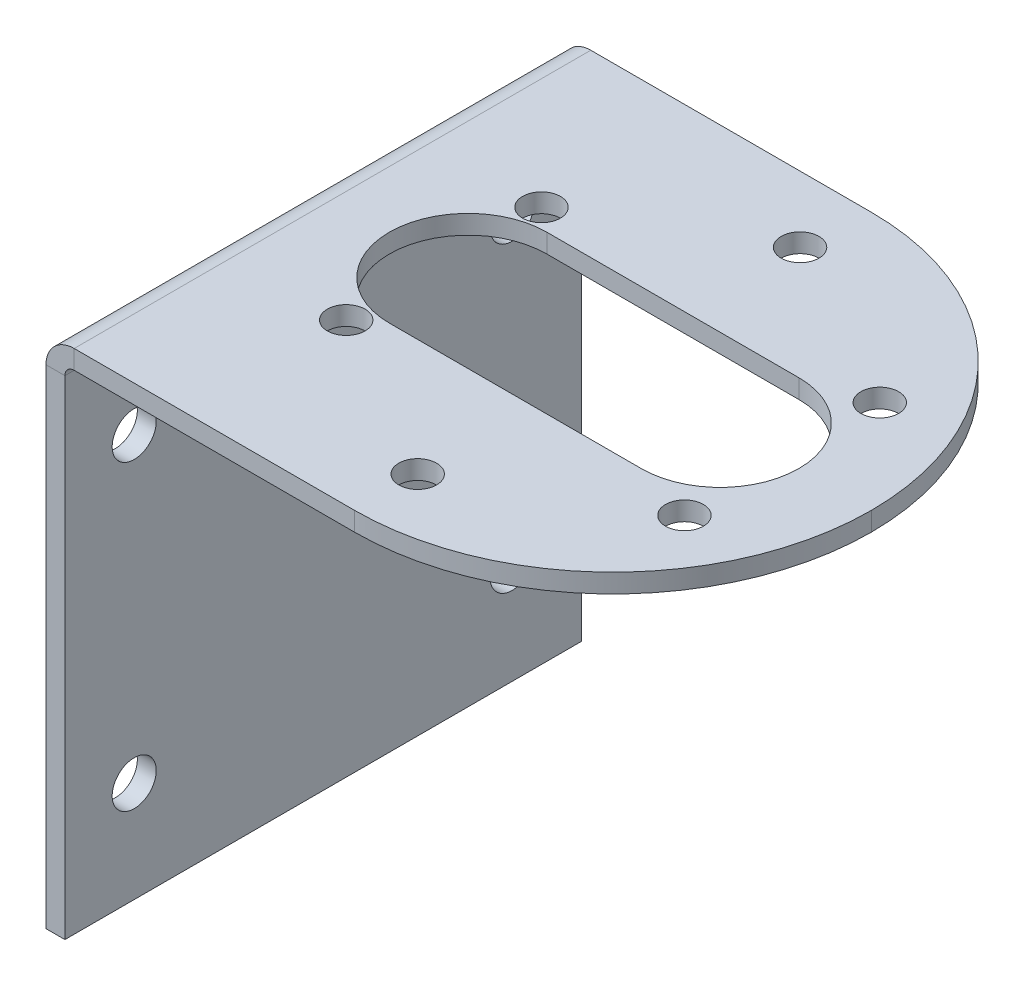
ISO-10303-21;
HEADER;
FILE_DESCRIPTION(('STEP AP214'),'2;1');
FILE_NAME('part.step','',(''),(''),'','','');
FILE_SCHEMA(('AUTOMOTIVE_DESIGN { 1 0 10303 214 1 1 1 1 }'));
ENDSEC;
DATA;
#1=APPLICATION_CONTEXT('core data for automotive mechanical design processes');
#2=APPLICATION_PROTOCOL_DEFINITION('international standard','automotive_design',2000,#1);
#3=PRODUCT_CONTEXT('',#1,'mechanical');
#4=PRODUCT('Part','Part','',(#3));
#5=PRODUCT_RELATED_PRODUCT_CATEGORY('part','',(#4));
#6=PRODUCT_DEFINITION_FORMATION('','',#4);
#7=PRODUCT_DEFINITION_CONTEXT('part definition',#1,'design');
#8=PRODUCT_DEFINITION('design','',#6,#7);
#9=PRODUCT_DEFINITION_SHAPE('','',#8);
#10=(LENGTH_UNIT() NAMED_UNIT(*) SI_UNIT(.MILLI.,.METRE.));
#11=(NAMED_UNIT(*) PLANE_ANGLE_UNIT() SI_UNIT($,.RADIAN.));
#12=(NAMED_UNIT(*) SI_UNIT($,.STERADIAN.) SOLID_ANGLE_UNIT());
#13=UNCERTAINTY_MEASURE_WITH_UNIT(LENGTH_MEASURE(1.E-05),#10,'distance_accuracy_value','');
#14=(GEOMETRIC_REPRESENTATION_CONTEXT(3) GLOBAL_UNCERTAINTY_ASSIGNED_CONTEXT((#13)) GLOBAL_UNIT_ASSIGNED_CONTEXT((#10,
#11,#12)) REPRESENTATION_CONTEXT('',''));
#15=CARTESIAN_POINT('',(0.,0.,0.));
#16=DIRECTION('',(0.,0.,1.));
#17=DIRECTION('',(1.,0.,0.));
#18=AXIS2_PLACEMENT_3D('',#15,#16,#17);
#19=CARTESIAN_POINT('',(2.2366,41.,20.5));
#20=DIRECTION('',(0.,0.,1.));
#21=DIRECTION('',(1.,0.,0.));
#22=AXIS2_PLACEMENT_3D('',#19,#20,#21);
#23=PLANE('',#22);
#24=DIRECTION('',(0.,-1.,0.));
#25=VECTOR('',#24,1.);
#26=CARTESIAN_POINT('',(2.2366,41.,20.5));
#27=LINE('',#26,#25);
#28=CARTESIAN_POINT('',(2.2366,41.,20.5));
#29=VERTEX_POINT('',#28);
#30=CARTESIAN_POINT('',(2.2366,39.5,20.5));
#31=VERTEX_POINT('',#30);
#32=EDGE_CURVE('E274',#29,#31,#27,.T.);
#33=ORIENTED_EDGE('',*,*,#32,.F.);
#34=CARTESIAN_POINT('',(2.2366,38.7634,20.5));
#35=DIRECTION('',(0.,0.,1.));
#36=DIRECTION('',(1.,0.,0.));
#37=AXIS2_PLACEMENT_3D('',#34,#35,#36);
#38=CIRCLE('',#37,2.2366);
#39=CARTESIAN_POINT('',(0.,38.7634,20.5));
#40=VERTEX_POINT('',#39);
#41=EDGE_CURVE('E217',#40,#29,#38,.F.);
#42=ORIENTED_EDGE('',*,*,#41,.F.);
#43=DIRECTION('',(-1.,0.,0.));
#44=VECTOR('',#43,1.);
#45=CARTESIAN_POINT('',(1.5,38.7634,20.5));
#46=LINE('',#45,#44);
#47=CARTESIAN_POINT('',(1.5,38.7634,20.5));
#48=VERTEX_POINT('',#47);
#49=EDGE_CURVE('E272',#48,#40,#46,.T.);
#50=ORIENTED_EDGE('',*,*,#49,.F.);
#51=CARTESIAN_POINT('',(2.2366,38.7634,20.5));
#52=DIRECTION('',(0.,0.,1.));
#53=DIRECTION('',(1.,0.,0.));
#54=AXIS2_PLACEMENT_3D('',#51,#52,#53);
#55=CIRCLE('',#54,0.7366);
#56=EDGE_CURVE('E229',#48,#31,#55,.F.);
#57=ORIENTED_EDGE('',*,*,#56,.T.);
#58=EDGE_LOOP('',(#33,#42,#50,#57));
#59=FACE_BOUND('',#58,.T.);
#60=ADVANCED_FACE('F37',(#59),#23,.T.);
#61=CARTESIAN_POINT('',(1.5,38.7634,20.5));
#62=DIRECTION('',(0.,0.,1.));
#63=DIRECTION('',(1.,0.,0.));
#64=AXIS2_PLACEMENT_3D('',#61,#62,#63);
#65=PLANE('',#64);
#66=DIRECTION('',(1.,0.,0.));
#67=VECTOR('',#66,1.);
#68=CARTESIAN_POINT('',(0.,39.5,20.5));
#69=LINE('',#68,#67);
#70=CARTESIAN_POINT('',(24.5,39.5,20.5));
#71=VERTEX_POINT('',#70);
#72=EDGE_CURVE('E210',#31,#71,#69,.T.);
#73=ORIENTED_EDGE('',*,*,#72,.T.);
#74=DIRECTION('',(0.,-1.,0.));
#75=VECTOR('',#74,1.);
#76=CARTESIAN_POINT('',(24.5,38.7634,20.5));
#77=LINE('',#76,#75);
#78=CARTESIAN_POINT('',(24.5,41.,20.5));
#79=VERTEX_POINT('',#78);
#80=EDGE_CURVE('E287',#71,#79,#77,.F.);
#81=ORIENTED_EDGE('',*,*,#80,.T.);
#82=DIRECTION('',(1.,0.,0.));
#83=VECTOR('',#82,1.);
#84=CARTESIAN_POINT('',(0.,41.,20.5));
#85=LINE('',#84,#83);
#86=EDGE_CURVE('E213',#29,#79,#85,.T.);
#87=ORIENTED_EDGE('',*,*,#86,.F.);
#88=ORIENTED_EDGE('',*,*,#32,.T.);
#89=EDGE_LOOP('',(#73,#81,#87,#88));
#90=FACE_BOUND('',#89,.T.);
#91=ADVANCED_FACE('F326',(#90),#65,.T.);
#92=CARTESIAN_POINT('',(0.,38.7634,-20.5));
#93=DIRECTION('',(0.,0.,-1.));
#94=DIRECTION('',(-1.,0.,0.));
#95=AXIS2_PLACEMENT_3D('',#92,#93,#94);
#96=PLANE('',#95);
#97=DIRECTION('',(1.,0.,0.));
#98=VECTOR('',#97,1.);
#99=CARTESIAN_POINT('',(0.,38.7634,-20.5));
#100=LINE('',#99,#98);
#101=CARTESIAN_POINT('',(0.,38.7634,-20.5));
#102=VERTEX_POINT('',#101);
#103=CARTESIAN_POINT('',(1.5,38.7634,-20.5));
#104=VERTEX_POINT('',#103);
#105=EDGE_CURVE('E270',#102,#104,#100,.T.);
#106=ORIENTED_EDGE('',*,*,#105,.F.);
#107=CARTESIAN_POINT('',(2.2366,38.7634,-20.5));
#108=DIRECTION('',(0.,0.,1.));
#109=DIRECTION('',(1.,0.,0.));
#110=AXIS2_PLACEMENT_3D('',#107,#108,#109);
#111=CIRCLE('',#110,2.2366);
#112=CARTESIAN_POINT('',(2.2366,41.,-20.5));
#113=VERTEX_POINT('',#112);
#114=EDGE_CURVE('E239',#102,#113,#111,.F.);
#115=ORIENTED_EDGE('',*,*,#114,.T.);
#116=DIRECTION('',(0.,1.,0.));
#117=VECTOR('',#116,1.);
#118=CARTESIAN_POINT('',(2.2366,39.5,-20.5));
#119=LINE('',#118,#117);
#120=CARTESIAN_POINT('',(2.2366,39.5,-20.5));
#121=VERTEX_POINT('',#120);
#122=EDGE_CURVE('E268',#121,#113,#119,.T.);
#123=ORIENTED_EDGE('',*,*,#122,.F.);
#124=CARTESIAN_POINT('',(2.2366,38.7634,-20.5));
#125=DIRECTION('',(0.,0.,1.));
#126=DIRECTION('',(1.,0.,0.));
#127=AXIS2_PLACEMENT_3D('',#124,#125,#126);
#128=CIRCLE('',#127,0.7366);
#129=EDGE_CURVE('E214',#104,#121,#128,.F.);
#130=ORIENTED_EDGE('',*,*,#129,.F.);
#131=EDGE_LOOP('',(#106,#115,#123,#130));
#132=FACE_BOUND('',#131,.T.);
#133=ADVANCED_FACE('F332',(#132),#96,.T.);
#134=CARTESIAN_POINT('',(2.2366,39.5,-20.5));
#135=DIRECTION('',(0.,0.,-1.));
#136=DIRECTION('',(-1.,0.,0.));
#137=AXIS2_PLACEMENT_3D('',#134,#135,#136);
#138=PLANE('',#137);
#139=DIRECTION('',(0.,1.,0.));
#140=VECTOR('',#139,1.);
#141=CARTESIAN_POINT('',(0.,0.,-20.5));
#142=LINE('',#141,#140);
#143=CARTESIAN_POINT('',(0.,0.,-20.5));
#144=VERTEX_POINT('',#143);
#145=EDGE_CURVE('E242',#144,#102,#142,.T.);
#146=ORIENTED_EDGE('',*,*,#145,.T.);
#147=ORIENTED_EDGE('',*,*,#105,.T.);
#148=DIRECTION('',(0.,1.,0.));
#149=VECTOR('',#148,1.);
#150=CARTESIAN_POINT('',(1.5,0.,-20.5));
#151=LINE('',#150,#149);
#152=CARTESIAN_POINT('',(1.5,0.,-20.5));
#153=VERTEX_POINT('',#152);
#154=EDGE_CURVE('E248',#153,#104,#151,.T.);
#155=ORIENTED_EDGE('',*,*,#154,.F.);
#156=DIRECTION('',(-1.,0.,0.));
#157=VECTOR('',#156,1.);
#158=CARTESIAN_POINT('',(1.5,0.,-20.5));
#159=LINE('',#158,#157);
#160=EDGE_CURVE('E245',#153,#144,#159,.T.);
#161=ORIENTED_EDGE('',*,*,#160,.T.);
#162=EDGE_LOOP('',(#146,#147,#155,#161));
#163=FACE_BOUND('',#162,.T.);
#164=ADVANCED_FACE('F388',(#163),#138,.T.);
#165=CARTESIAN_POINT('',(0.,39.5,20.5));
#166=DIRECTION('',(0.,1.,0.));
#167=DIRECTION('',(0.,0.,1.));
#168=AXIS2_PLACEMENT_3D('',#165,#166,#167);
#169=PLANE('',#168);
#170=DIRECTION('',(-1.,0.,0.));
#171=VECTOR('',#170,1.);
#172=CARTESIAN_POINT('',(33.,39.5,6.25));
#173=LINE('',#172,#171);
#174=CARTESIAN_POINT('',(33.,39.5,6.25));
#175=VERTEX_POINT('',#174);
#176=CARTESIAN_POINT('',(13.,39.5,6.25));
#177=VERTEX_POINT('',#176);
#178=EDGE_CURVE('E143',#175,#177,#173,.T.);
#179=ORIENTED_EDGE('',*,*,#178,.F.);
#180=CARTESIAN_POINT('',(33.,39.5,0.));
#181=DIRECTION('',(0.,-1.,0.));
#182=DIRECTION('',(0.,0.,-1.));
#183=AXIS2_PLACEMENT_3D('',#180,#181,#182);
#184=CIRCLE('',#183,6.25);
#185=CARTESIAN_POINT('',(33.,39.5,-6.25));
#186=VERTEX_POINT('',#185);
#187=EDGE_CURVE('E52',#186,#175,#184,.T.);
#188=ORIENTED_EDGE('',*,*,#187,.F.);
#189=DIRECTION('',(1.,0.,0.));
#190=VECTOR('',#189,1.);
#191=CARTESIAN_POINT('',(33.,39.5,-6.25));
#192=LINE('',#191,#190);
#193=CARTESIAN_POINT('',(13.,39.5,-6.25));
#194=VERTEX_POINT('',#193);
#195=EDGE_CURVE('E150',#194,#186,#192,.T.);
#196=ORIENTED_EDGE('',*,*,#195,.F.);
#197=CARTESIAN_POINT('',(13.,39.5,0.));
#198=DIRECTION('',(0.,-1.,0.));
#199=DIRECTION('',(0.,0.,-1.));
#200=AXIS2_PLACEMENT_3D('',#197,#198,#199);
#201=CIRCLE('',#200,6.25);
#202=EDGE_CURVE('E134',#177,#194,#201,.T.);
#203=ORIENTED_EDGE('',*,*,#202,.F.);
#204=EDGE_LOOP('',(#179,#188,#196,#203));
#205=FACE_BOUND('',#204,.T.);
#206=CARTESIAN_POINT('',(24.0871270426121,39.5,-15.261627686911));
#207=DIRECTION('',(0.,1.,0.));
#208=DIRECTION('',(0.,0.,1.));
#209=AXIS2_PLACEMENT_3D('',#206,#207,#208);
#210=CIRCLE('',#209,1.5);
#211=CARTESIAN_POINT('',(24.0871270426121,39.5,-13.761627686911));
#212=VERTEX_POINT('',#211);
#213=EDGE_CURVE('E175',#212,#212,#210,.T.);
#214=ORIENTED_EDGE('',*,*,#213,.T.);
#215=EDGE_LOOP('',(#214));
#216=FACE_BOUND('',#215,.T.);
#217=CARTESIAN_POINT('',(37.9233937586588,39.5,-7.75));
#218=DIRECTION('',(0.,1.,0.));
#219=DIRECTION('',(0.,0.,1.));
#220=AXIS2_PLACEMENT_3D('',#217,#218,#219);
#221=CIRCLE('',#220,1.5);
#222=CARTESIAN_POINT('',(37.9233937586588,39.5,-6.25));
#223=VERTEX_POINT('',#222);
#224=EDGE_CURVE('E182',#223,#223,#221,.T.);
#225=ORIENTED_EDGE('',*,*,#224,.T.);
#226=EDGE_LOOP('',(#225));
#227=FACE_BOUND('',#226,.T.);
#228=CARTESIAN_POINT('',(37.9233937586588,39.5,7.75));
#229=DIRECTION('',(0.,1.,0.));
#230=DIRECTION('',(0.,0.,1.));
#231=AXIS2_PLACEMENT_3D('',#228,#229,#230);
#232=CIRCLE('',#231,1.5);
#233=CARTESIAN_POINT('',(37.9233937586588,39.5,9.25));
#234=VERTEX_POINT('',#233);
#235=EDGE_CURVE('E188',#234,#234,#232,.T.);
#236=ORIENTED_EDGE('',*,*,#235,.T.);
#237=EDGE_LOOP('',(#236));
#238=FACE_BOUND('',#237,.T.);
#239=CARTESIAN_POINT('',(24.5,39.5,15.5));
#240=DIRECTION('',(0.,1.,0.));
#241=DIRECTION('',(0.,0.,1.));
#242=AXIS2_PLACEMENT_3D('',#239,#240,#241);
#243=CIRCLE('',#242,1.5);
#244=CARTESIAN_POINT('',(24.5,39.5,17.));
#245=VERTEX_POINT('',#244);
#246=EDGE_CURVE('E194',#245,#245,#243,.T.);
#247=ORIENTED_EDGE('',*,*,#246,.T.);
#248=EDGE_LOOP('',(#247));
#249=FACE_BOUND('',#248,.T.);
#250=CARTESIAN_POINT('',(11.0766062413412,39.5,7.75));
#251=DIRECTION('',(0.,1.,0.));
#252=DIRECTION('',(0.,0.,1.));
#253=AXIS2_PLACEMENT_3D('',#250,#251,#252);
#254=CIRCLE('',#253,1.5);
#255=CARTESIAN_POINT('',(11.0766062413412,39.5,9.25));
#256=VERTEX_POINT('',#255);
#257=EDGE_CURVE('E200',#256,#256,#254,.T.);
#258=ORIENTED_EDGE('',*,*,#257,.T.);
#259=EDGE_LOOP('',(#258));
#260=FACE_BOUND('',#259,.T.);
#261=CARTESIAN_POINT('',(11.0766062413412,39.5,-7.75));
#262=DIRECTION('',(0.,1.,0.));
#263=DIRECTION('',(0.,0.,1.));
#264=AXIS2_PLACEMENT_3D('',#261,#262,#263);
#265=CIRCLE('',#264,1.5);
#266=CARTESIAN_POINT('',(11.0766062413412,39.5,-6.25));
#267=VERTEX_POINT('',#266);
#268=EDGE_CURVE('E206',#267,#267,#265,.T.);
#269=ORIENTED_EDGE('',*,*,#268,.T.);
#270=EDGE_LOOP('',(#269));
#271=FACE_BOUND('',#270,.T.);
#272=DIRECTION('',(1.,0.,0.));
#273=VECTOR('',#272,1.);
#274=CARTESIAN_POINT('',(0.,39.5,-20.5));
#275=LINE('',#274,#273);
#276=CARTESIAN_POINT('',(24.5,39.5,-20.5));
#277=VERTEX_POINT('',#276);
#278=EDGE_CURVE('E233',#121,#277,#275,.T.);
#279=ORIENTED_EDGE('',*,*,#278,.T.);
#280=CARTESIAN_POINT('',(24.5,39.5,0.));
#281=DIRECTION('',(0.,1.,0.));
#282=DIRECTION('',(0.,0.,1.));
#283=AXIS2_PLACEMENT_3D('',#280,#281,#282);
#284=CIRCLE('',#283,20.5);
#285=CARTESIAN_POINT('',(45.,39.5,0.));
#286=VERTEX_POINT('',#285);
#287=EDGE_CURVE('E281',#277,#286,#284,.F.);
#288=ORIENTED_EDGE('',*,*,#287,.T.);
#289=CARTESIAN_POINT('',(24.5,39.5,0.));
#290=DIRECTION('',(0.,1.,0.));
#291=DIRECTION('',(0.,0.,1.));
#292=AXIS2_PLACEMENT_3D('',#289,#290,#291);
#293=CIRCLE('',#292,20.5);
#294=EDGE_CURVE('E279',#286,#71,#293,.F.);
#295=ORIENTED_EDGE('',*,*,#294,.T.);
#296=ORIENTED_EDGE('',*,*,#72,.F.);
#297=DIRECTION('',(0.,0.,-1.));
#298=VECTOR('',#297,1.);
#299=CARTESIAN_POINT('',(2.2366,39.5,20.5));
#300=LINE('',#299,#298);
#301=EDGE_CURVE('E232',#31,#121,#300,.T.);
#302=ORIENTED_EDGE('',*,*,#301,.T.);
#303=EDGE_LOOP('',(#279,#288,#295,#296,#302));
#304=FACE_BOUND('',#303,.T.);
#305=ADVANCED_FACE('F147',(#205,#216,#227,#238,#249,#260,#271,#304),#169,.F.);
#306=CARTESIAN_POINT('',(0.,41.,20.5));
#307=DIRECTION('',(0.,1.,0.));
#308=DIRECTION('',(0.,0.,1.));
#309=AXIS2_PLACEMENT_3D('',#306,#307,#308);
#310=PLANE('',#309);
#311=CARTESIAN_POINT('',(33.,41.,0.));
#312=DIRECTION('',(0.,1.,0.));
#313=DIRECTION('',(0.,0.,1.));
#314=AXIS2_PLACEMENT_3D('',#311,#312,#313);
#315=CIRCLE('',#314,6.25);
#316=CARTESIAN_POINT('',(33.,41.,6.25));
#317=VERTEX_POINT('',#316);
#318=CARTESIAN_POINT('',(33.,41.,-6.25));
#319=VERTEX_POINT('',#318);
#320=EDGE_CURVE('E11',#317,#319,#315,.T.);
#321=ORIENTED_EDGE('',*,*,#320,.F.);
#322=DIRECTION('',(1.,0.,0.));
#323=VECTOR('',#322,1.);
#324=CARTESIAN_POINT('',(0.,41.,6.25));
#325=LINE('',#324,#323);
#326=CARTESIAN_POINT('',(13.,41.,6.25));
#327=VERTEX_POINT('',#326);
#328=EDGE_CURVE('E289',#327,#317,#325,.T.);
#329=ORIENTED_EDGE('',*,*,#328,.F.);
#330=CARTESIAN_POINT('',(13.,41.,0.));
#331=DIRECTION('',(0.,1.,0.));
#332=DIRECTION('',(0.,0.,1.));
#333=AXIS2_PLACEMENT_3D('',#330,#331,#332);
#334=CIRCLE('',#333,6.25);
#335=CARTESIAN_POINT('',(13.,41.,-6.25));
#336=VERTEX_POINT('',#335);
#337=EDGE_CURVE('E137',#336,#327,#334,.T.);
#338=ORIENTED_EDGE('',*,*,#337,.F.);
#339=DIRECTION('',(-1.,0.,0.));
#340=VECTOR('',#339,1.);
#341=CARTESIAN_POINT('',(0.,41.,-6.25000000000001));
#342=LINE('',#341,#340);
#343=EDGE_CURVE('E45',#319,#336,#342,.T.);
#344=ORIENTED_EDGE('',*,*,#343,.F.);
#345=EDGE_LOOP('',(#321,#329,#338,#344));
#346=FACE_BOUND('',#345,.T.);
#347=CARTESIAN_POINT('',(24.0871270426121,41.,-15.261627686911));
#348=DIRECTION('',(0.,1.,0.));
#349=DIRECTION('',(0.,0.,1.));
#350=AXIS2_PLACEMENT_3D('',#347,#348,#349);
#351=CIRCLE('',#350,1.5);
#352=CARTESIAN_POINT('',(24.0871270426121,41.,-13.761627686911));
#353=VERTEX_POINT('',#352);
#354=EDGE_CURVE('E172',#353,#353,#351,.T.);
#355=ORIENTED_EDGE('',*,*,#354,.F.);
#356=EDGE_LOOP('',(#355));
#357=FACE_BOUND('',#356,.T.);
#358=CARTESIAN_POINT('',(37.9233937586588,41.,-7.75));
#359=DIRECTION('',(0.,1.,0.));
#360=DIRECTION('',(0.,0.,1.));
#361=AXIS2_PLACEMENT_3D('',#358,#359,#360);
#362=CIRCLE('',#361,1.5);
#363=CARTESIAN_POINT('',(37.9233937586588,41.,-6.25));
#364=VERTEX_POINT('',#363);
#365=EDGE_CURVE('E179',#364,#364,#362,.T.);
#366=ORIENTED_EDGE('',*,*,#365,.F.);
#367=EDGE_LOOP('',(#366));
#368=FACE_BOUND('',#367,.T.);
#369=CARTESIAN_POINT('',(37.9233937586588,41.,7.75));
#370=DIRECTION('',(0.,1.,0.));
#371=DIRECTION('',(0.,0.,1.));
#372=AXIS2_PLACEMENT_3D('',#369,#370,#371);
#373=CIRCLE('',#372,1.5);
#374=CARTESIAN_POINT('',(37.9233937586588,41.,9.25));
#375=VERTEX_POINT('',#374);
#376=EDGE_CURVE('E185',#375,#375,#373,.T.);
#377=ORIENTED_EDGE('',*,*,#376,.F.);
#378=EDGE_LOOP('',(#377));
#379=FACE_BOUND('',#378,.T.);
#380=CARTESIAN_POINT('',(24.5,41.,15.5));
#381=DIRECTION('',(0.,1.,0.));
#382=DIRECTION('',(0.,0.,1.));
#383=AXIS2_PLACEMENT_3D('',#380,#381,#382);
#384=CIRCLE('',#383,1.5);
#385=CARTESIAN_POINT('',(24.5,41.,17.));
#386=VERTEX_POINT('',#385);
#387=EDGE_CURVE('E191',#386,#386,#384,.T.);
#388=ORIENTED_EDGE('',*,*,#387,.F.);
#389=EDGE_LOOP('',(#388));
#390=FACE_BOUND('',#389,.T.);
#391=CARTESIAN_POINT('',(11.0766062413412,41.,7.75));
#392=DIRECTION('',(0.,1.,0.));
#393=DIRECTION('',(0.,0.,1.));
#394=AXIS2_PLACEMENT_3D('',#391,#392,#393);
#395=CIRCLE('',#394,1.5);
#396=CARTESIAN_POINT('',(11.0766062413412,41.,9.25));
#397=VERTEX_POINT('',#396);
#398=EDGE_CURVE('E197',#397,#397,#395,.T.);
#399=ORIENTED_EDGE('',*,*,#398,.F.);
#400=EDGE_LOOP('',(#399));
#401=FACE_BOUND('',#400,.T.);
#402=CARTESIAN_POINT('',(11.0766062413412,41.,-7.75));
#403=DIRECTION('',(0.,1.,0.));
#404=DIRECTION('',(0.,0.,1.));
#405=AXIS2_PLACEMENT_3D('',#402,#403,#404);
#406=CIRCLE('',#405,1.5);
#407=CARTESIAN_POINT('',(11.0766062413412,41.,-6.25));
#408=VERTEX_POINT('',#407);
#409=EDGE_CURVE('E203',#408,#408,#406,.T.);
#410=ORIENTED_EDGE('',*,*,#409,.F.);
#411=EDGE_LOOP('',(#410));
#412=FACE_BOUND('',#411,.T.);
#413=CARTESIAN_POINT('',(24.5,41.,0.));
#414=DIRECTION('',(0.,1.,0.));
#415=DIRECTION('',(0.,0.,1.));
#416=AXIS2_PLACEMENT_3D('',#413,#414,#415);
#417=CIRCLE('',#416,20.5);
#418=CARTESIAN_POINT('',(45.,41.,0.));
#419=VERTEX_POINT('',#418);
#420=EDGE_CURVE('E283',#79,#419,#417,.T.);
#421=ORIENTED_EDGE('',*,*,#420,.T.);
#422=CARTESIAN_POINT('',(24.5,41.,0.));
#423=DIRECTION('',(0.,1.,0.));
#424=DIRECTION('',(0.,0.,1.));
#425=AXIS2_PLACEMENT_3D('',#422,#423,#424);
#426=CIRCLE('',#425,20.5);
#427=CARTESIAN_POINT('',(24.5,41.,-20.5));
#428=VERTEX_POINT('',#427);
#429=EDGE_CURVE('E285',#419,#428,#426,.T.);
#430=ORIENTED_EDGE('',*,*,#429,.T.);
#431=DIRECTION('',(1.,0.,0.));
#432=VECTOR('',#431,1.);
#433=CARTESIAN_POINT('',(0.,41.,-20.5));
#434=LINE('',#433,#432);
#435=EDGE_CURVE('E236',#113,#428,#434,.T.);
#436=ORIENTED_EDGE('',*,*,#435,.F.);
#437=DIRECTION('',(0.,0.,-1.));
#438=VECTOR('',#437,1.);
#439=CARTESIAN_POINT('',(2.2366,41.,20.5));
#440=LINE('',#439,#438);
#441=EDGE_CURVE('E265',#29,#113,#440,.T.);
#442=ORIENTED_EDGE('',*,*,#441,.F.);
#443=ORIENTED_EDGE('',*,*,#86,.T.);
#444=EDGE_LOOP('',(#421,#430,#436,#442,#443));
#445=FACE_BOUND('',#444,.T.);
#446=ADVANCED_FACE('F309',(#346,#357,#368,#379,#390,#401,#412,#445),#310,.T.);
#447=CARTESIAN_POINT('',(2.2366,38.7634,20.5));
#448=DIRECTION('',(0.,0.,-1.));
#449=DIRECTION('',(-1.,0.,0.));
#450=AXIS2_PLACEMENT_3D('',#447,#448,#449);
#451=CYLINDRICAL_SURFACE('',#450,2.2366);
#452=ORIENTED_EDGE('',*,*,#114,.F.);
#453=DIRECTION('',(0.,0.,-1.));
#454=VECTOR('',#453,1.);
#455=CARTESIAN_POINT('',(0.,38.7634,20.5));
#456=LINE('',#455,#454);
#457=EDGE_CURVE('E262',#40,#102,#456,.T.);
#458=ORIENTED_EDGE('',*,*,#457,.F.);
#459=ORIENTED_EDGE('',*,*,#41,.T.);
#460=ORIENTED_EDGE('',*,*,#441,.T.);
#461=EDGE_LOOP('',(#452,#458,#459,#460));
#462=FACE_BOUND('',#461,.T.);
#463=ADVANCED_FACE('F362',(#462),#451,.T.);
#464=CARTESIAN_POINT('',(0.,0.,20.5));
#465=DIRECTION('',(-1.,0.,0.));
#466=DIRECTION('',(0.,0.,1.));
#467=AXIS2_PLACEMENT_3D('',#464,#465,#466);
#468=PLANE('',#467);
#469=CARTESIAN_POINT('',(0.,8.00000000000001,-15.));
#470=DIRECTION('',(-1.,0.,0.));
#471=DIRECTION('',(0.,0.,1.));
#472=AXIS2_PLACEMENT_3D('',#469,#470,#471);
#473=CIRCLE('',#472,1.75);
#474=CARTESIAN_POINT('',(0.,8.00000000000001,-13.25));
#475=VERTEX_POINT('',#474);
#476=EDGE_CURVE('E157',#475,#475,#473,.T.);
#477=ORIENTED_EDGE('',*,*,#476,.F.);
#478=EDGE_LOOP('',(#477));
#479=FACE_BOUND('',#478,.T.);
#480=CARTESIAN_POINT('',(0.,8.,15.));
#481=DIRECTION('',(-1.,0.,0.));
#482=DIRECTION('',(0.,0.,1.));
#483=AXIS2_PLACEMENT_3D('',#480,#481,#482);
#484=CIRCLE('',#483,1.75);
#485=CARTESIAN_POINT('',(0.,8.,16.75));
#486=VERTEX_POINT('',#485);
#487=EDGE_CURVE('E164',#486,#486,#484,.T.);
#488=ORIENTED_EDGE('',*,*,#487,.F.);
#489=EDGE_LOOP('',(#488));
#490=FACE_BOUND('',#489,.T.);
#491=CARTESIAN_POINT('',(0.,32.,15.));
#492=DIRECTION('',(-1.,0.,0.));
#493=DIRECTION('',(0.,0.,1.));
#494=AXIS2_PLACEMENT_3D('',#491,#492,#493);
#495=CIRCLE('',#494,1.75);
#496=CARTESIAN_POINT('',(0.,32.,16.75));
#497=VERTEX_POINT('',#496);
#498=EDGE_CURVE('E160',#497,#497,#495,.T.);
#499=ORIENTED_EDGE('',*,*,#498,.F.);
#500=EDGE_LOOP('',(#499));
#501=FACE_BOUND('',#500,.T.);
#502=CARTESIAN_POINT('',(0.,32.,-15.));
#503=DIRECTION('',(-1.,0.,0.));
#504=DIRECTION('',(0.,0.,1.));
#505=AXIS2_PLACEMENT_3D('',#502,#503,#504);
#506=CIRCLE('',#505,1.75);
#507=CARTESIAN_POINT('',(0.,32.,-13.25));
#508=VERTEX_POINT('',#507);
#509=EDGE_CURVE('E163',#508,#508,#506,.T.);
#510=ORIENTED_EDGE('',*,*,#509,.F.);
#511=EDGE_LOOP('',(#510));
#512=FACE_BOUND('',#511,.T.);
#513=ORIENTED_EDGE('',*,*,#145,.F.);
#514=DIRECTION('',(0.,0.,-1.));
#515=VECTOR('',#514,1.);
#516=CARTESIAN_POINT('',(0.,0.,20.5));
#517=LINE('',#516,#515);
#518=CARTESIAN_POINT('',(0.,0.,20.5));
#519=VERTEX_POINT('',#518);
#520=EDGE_CURVE('E260',#519,#144,#517,.T.);
#521=ORIENTED_EDGE('',*,*,#520,.F.);
#522=DIRECTION('',(0.,1.,0.));
#523=VECTOR('',#522,1.);
#524=CARTESIAN_POINT('',(0.,0.,20.5));
#525=LINE('',#524,#523);
#526=EDGE_CURVE('E220',#519,#40,#525,.T.);
#527=ORIENTED_EDGE('',*,*,#526,.T.);
#528=ORIENTED_EDGE('',*,*,#457,.T.);
#529=EDGE_LOOP('',(#513,#521,#527,#528));
#530=FACE_BOUND('',#529,.T.);
#531=ADVANCED_FACE('F379',(#479,#490,#501,#512,#530),#468,.T.);
#532=CARTESIAN_POINT('',(1.5,0.,20.5));
#533=DIRECTION('',(0.,-1.,0.));
#534=DIRECTION('',(0.,0.,-1.));
#535=AXIS2_PLACEMENT_3D('',#532,#533,#534);
#536=PLANE('',#535);
#537=ORIENTED_EDGE('',*,*,#160,.F.);
#538=DIRECTION('',(0.,0.,-1.));
#539=VECTOR('',#538,1.);
#540=CARTESIAN_POINT('',(1.5,0.,20.5));
#541=LINE('',#540,#539);
#542=CARTESIAN_POINT('',(1.5,0.,20.5));
#543=VERTEX_POINT('',#542);
#544=EDGE_CURVE('E258',#543,#153,#541,.T.);
#545=ORIENTED_EDGE('',*,*,#544,.F.);
#546=DIRECTION('',(-1.,0.,0.));
#547=VECTOR('',#546,1.);
#548=CARTESIAN_POINT('',(1.5,0.,20.5));
#549=LINE('',#548,#547);
#550=EDGE_CURVE('E223',#543,#519,#549,.T.);
#551=ORIENTED_EDGE('',*,*,#550,.T.);
#552=ORIENTED_EDGE('',*,*,#520,.T.);
#553=EDGE_LOOP('',(#537,#545,#551,#552));
#554=FACE_BOUND('',#553,.T.);
#555=ADVANCED_FACE('F390',(#554),#536,.T.);
#556=CARTESIAN_POINT('',(1.5,0.,20.5));
#557=DIRECTION('',(-1.,0.,0.));
#558=DIRECTION('',(0.,0.,1.));
#559=AXIS2_PLACEMENT_3D('',#556,#557,#558);
#560=PLANE('',#559);
#561=CARTESIAN_POINT('',(1.5,8.00000000000001,-15.));
#562=DIRECTION('',(-1.,0.,0.));
#563=DIRECTION('',(0.,0.,1.));
#564=AXIS2_PLACEMENT_3D('',#561,#562,#563);
#565=CIRCLE('',#564,1.75);
#566=CARTESIAN_POINT('',(1.5,8.00000000000001,-13.25));
#567=VERTEX_POINT('',#566);
#568=EDGE_CURVE('E176',#567,#567,#565,.T.);
#569=ORIENTED_EDGE('',*,*,#568,.T.);
#570=EDGE_LOOP('',(#569));
#571=FACE_BOUND('',#570,.T.);
#572=CARTESIAN_POINT('',(1.5,8.,15.));
#573=DIRECTION('',(-1.,0.,0.));
#574=DIRECTION('',(0.,0.,1.));
#575=AXIS2_PLACEMENT_3D('',#572,#573,#574);
#576=CIRCLE('',#575,1.75);
#577=CARTESIAN_POINT('',(1.5,8.,16.75));
#578=VERTEX_POINT('',#577);
#579=EDGE_CURVE('E297',#578,#578,#576,.T.);
#580=ORIENTED_EDGE('',*,*,#579,.T.);
#581=EDGE_LOOP('',(#580));
#582=FACE_BOUND('',#581,.T.);
#583=CARTESIAN_POINT('',(1.5,32.,15.));
#584=DIRECTION('',(-1.,0.,0.));
#585=DIRECTION('',(0.,0.,1.));
#586=AXIS2_PLACEMENT_3D('',#583,#584,#585);
#587=CIRCLE('',#586,1.75);
#588=CARTESIAN_POINT('',(1.5,32.,16.75));
#589=VERTEX_POINT('',#588);
#590=EDGE_CURVE('E294',#589,#589,#587,.T.);
#591=ORIENTED_EDGE('',*,*,#590,.T.);
#592=EDGE_LOOP('',(#591));
#593=FACE_BOUND('',#592,.T.);
#594=CARTESIAN_POINT('',(1.5,32.,-15.));
#595=DIRECTION('',(-1.,0.,0.));
#596=DIRECTION('',(0.,0.,1.));
#597=AXIS2_PLACEMENT_3D('',#594,#595,#596);
#598=CIRCLE('',#597,1.75);
#599=CARTESIAN_POINT('',(1.5,32.,-13.25));
#600=VERTEX_POINT('',#599);
#601=EDGE_CURVE('E171',#600,#600,#598,.T.);
#602=ORIENTED_EDGE('',*,*,#601,.T.);
#603=EDGE_LOOP('',(#602));
#604=FACE_BOUND('',#603,.T.);
#605=ORIENTED_EDGE('',*,*,#154,.T.);
#606=DIRECTION('',(0.,0.,-1.));
#607=VECTOR('',#606,1.);
#608=CARTESIAN_POINT('',(1.5,38.7634,20.5));
#609=LINE('',#608,#607);
#610=EDGE_CURVE('E255',#48,#104,#609,.T.);
#611=ORIENTED_EDGE('',*,*,#610,.F.);
#612=DIRECTION('',(0.,1.,0.));
#613=VECTOR('',#612,1.);
#614=CARTESIAN_POINT('',(1.5,0.,20.5));
#615=LINE('',#614,#613);
#616=EDGE_CURVE('E226',#543,#48,#615,.T.);
#617=ORIENTED_EDGE('',*,*,#616,.F.);
#618=ORIENTED_EDGE('',*,*,#544,.T.);
#619=EDGE_LOOP('',(#605,#611,#617,#618));
#620=FACE_BOUND('',#619,.T.);
#621=ADVANCED_FACE('F386',(#571,#582,#593,#604,#620),#560,.F.);
#622=CARTESIAN_POINT('',(2.2366,38.7634,20.5));
#623=DIRECTION('',(0.,0.,-1.));
#624=DIRECTION('',(-1.,0.,0.));
#625=AXIS2_PLACEMENT_3D('',#622,#623,#624);
#626=CYLINDRICAL_SURFACE('',#625,0.7366);
#627=ORIENTED_EDGE('',*,*,#129,.T.);
#628=ORIENTED_EDGE('',*,*,#301,.F.);
#629=ORIENTED_EDGE('',*,*,#56,.F.);
#630=ORIENTED_EDGE('',*,*,#610,.T.);
#631=EDGE_LOOP('',(#627,#628,#629,#630));
#632=FACE_BOUND('',#631,.T.);
#633=ADVANCED_FACE('F373',(#632),#626,.F.);
#634=CARTESIAN_POINT('',(2.2366,38.7634,20.5));
#635=DIRECTION('',(0.,0.,1.));
#636=DIRECTION('',(1.,0.,0.));
#637=AXIS2_PLACEMENT_3D('',#634,#635,#636);
#638=PLANE('',#637);
#639=ORIENTED_EDGE('',*,*,#616,.T.);
#640=ORIENTED_EDGE('',*,*,#49,.T.);
#641=ORIENTED_EDGE('',*,*,#526,.F.);
#642=ORIENTED_EDGE('',*,*,#550,.F.);
#643=EDGE_LOOP('',(#639,#640,#641,#642));
#644=FACE_BOUND('',#643,.T.);
#645=ADVANCED_FACE('F384',(#644),#638,.T.);
#646=CARTESIAN_POINT('',(2.2366,38.7634,-20.5));
#647=DIRECTION('',(0.,0.,1.));
#648=DIRECTION('',(1.,0.,0.));
#649=AXIS2_PLACEMENT_3D('',#646,#647,#648);
#650=PLANE('',#649);
#651=ORIENTED_EDGE('',*,*,#435,.T.);
#652=DIRECTION('',(0.,-1.,0.));
#653=VECTOR('',#652,1.);
#654=CARTESIAN_POINT('',(24.5,39.5,-20.5));
#655=LINE('',#654,#653);
#656=EDGE_CURVE('E276',#428,#277,#655,.T.);
#657=ORIENTED_EDGE('',*,*,#656,.T.);
#658=ORIENTED_EDGE('',*,*,#278,.F.);
#659=ORIENTED_EDGE('',*,*,#122,.T.);
#660=EDGE_LOOP('',(#651,#657,#658,#659));
#661=FACE_BOUND('',#660,.T.);
#662=ADVANCED_FACE('F347',(#661),#650,.F.);
#663=CARTESIAN_POINT('',(24.5,41.,0.));
#664=DIRECTION('',(0.,-1.,0.));
#665=DIRECTION('',(0.,0.,-1.));
#666=AXIS2_PLACEMENT_3D('',#663,#664,#665);
#667=CYLINDRICAL_SURFACE('',#666,20.5);
#668=DIRECTION('',(0.,-1.,0.));
#669=VECTOR('',#668,1.);
#670=CARTESIAN_POINT('',(45.,41.,0.));
#671=LINE('',#670,#669);
#672=EDGE_CURVE('E209',#419,#286,#671,.T.);
#673=ORIENTED_EDGE('',*,*,#672,.F.);
#674=ORIENTED_EDGE('',*,*,#420,.F.);
#675=ORIENTED_EDGE('',*,*,#80,.F.);
#676=ORIENTED_EDGE('',*,*,#294,.F.);
#677=EDGE_LOOP('',(#673,#674,#675,#676));
#678=FACE_BOUND('',#677,.T.);
#679=ADVANCED_FACE('F39',(#678),#667,.T.);
#680=CARTESIAN_POINT('',(24.5,38.7634,0.));
#681=DIRECTION('',(0.,1.,0.));
#682=DIRECTION('',(0.,0.,1.));
#683=AXIS2_PLACEMENT_3D('',#680,#681,#682);
#684=CYLINDRICAL_SURFACE('',#683,20.5);
#685=ORIENTED_EDGE('',*,*,#429,.F.);
#686=ORIENTED_EDGE('',*,*,#672,.T.);
#687=ORIENTED_EDGE('',*,*,#287,.F.);
#688=ORIENTED_EDGE('',*,*,#656,.F.);
#689=EDGE_LOOP('',(#685,#686,#687,#688));
#690=FACE_BOUND('',#689,.T.);
#691=ADVANCED_FACE('F336',(#690),#684,.T.);
#692=CARTESIAN_POINT('',(11.0766062413412,41.,-7.75));
#693=DIRECTION('',(0.,1.,0.));
#694=DIRECTION('',(0.,0.,1.));
#695=AXIS2_PLACEMENT_3D('',#692,#693,#694);
#696=CYLINDRICAL_SURFACE('',#695,1.5);
#697=ORIENTED_EDGE('',*,*,#409,.T.);
#698=EDGE_LOOP('',(#697));
#699=FACE_BOUND('',#698,.T.);
#700=ORIENTED_EDGE('',*,*,#268,.F.);
#701=EDGE_LOOP('',(#700));
#702=FACE_BOUND('',#701,.T.);
#703=ADVANCED_FACE('F338',(#699,#702),#696,.F.);
#704=CARTESIAN_POINT('',(11.0766062413412,41.,7.75));
#705=DIRECTION('',(0.,1.,0.));
#706=DIRECTION('',(0.,0.,1.));
#707=AXIS2_PLACEMENT_3D('',#704,#705,#706);
#708=CYLINDRICAL_SURFACE('',#707,1.5);
#709=ORIENTED_EDGE('',*,*,#398,.T.);
#710=EDGE_LOOP('',(#709));
#711=FACE_BOUND('',#710,.T.);
#712=ORIENTED_EDGE('',*,*,#257,.F.);
#713=EDGE_LOOP('',(#712));
#714=FACE_BOUND('',#713,.T.);
#715=ADVANCED_FACE('F344',(#711,#714),#708,.F.);
#716=CARTESIAN_POINT('',(24.5,41.,15.5));
#717=DIRECTION('',(0.,1.,0.));
#718=DIRECTION('',(0.,0.,1.));
#719=AXIS2_PLACEMENT_3D('',#716,#717,#718);
#720=CYLINDRICAL_SURFACE('',#719,1.5);
#721=ORIENTED_EDGE('',*,*,#387,.T.);
#722=EDGE_LOOP('',(#721));
#723=FACE_BOUND('',#722,.T.);
#724=ORIENTED_EDGE('',*,*,#246,.F.);
#725=EDGE_LOOP('',(#724));
#726=FACE_BOUND('',#725,.T.);
#727=ADVANCED_FACE('F613',(#723,#726),#720,.F.);
#728=CARTESIAN_POINT('',(37.9233937586588,41.,7.75));
#729=DIRECTION('',(0.,1.,0.));
#730=DIRECTION('',(0.,0.,1.));
#731=AXIS2_PLACEMENT_3D('',#728,#729,#730);
#732=CYLINDRICAL_SURFACE('',#731,1.5);
#733=ORIENTED_EDGE('',*,*,#376,.T.);
#734=EDGE_LOOP('',(#733));
#735=FACE_BOUND('',#734,.T.);
#736=ORIENTED_EDGE('',*,*,#235,.F.);
#737=EDGE_LOOP('',(#736));
#738=FACE_BOUND('',#737,.T.);
#739=ADVANCED_FACE('F623',(#735,#738),#732,.F.);
#740=CARTESIAN_POINT('',(37.9233937586588,41.,-7.75));
#741=DIRECTION('',(0.,1.,0.));
#742=DIRECTION('',(0.,0.,1.));
#743=AXIS2_PLACEMENT_3D('',#740,#741,#742);
#744=CYLINDRICAL_SURFACE('',#743,1.5);
#745=ORIENTED_EDGE('',*,*,#365,.T.);
#746=EDGE_LOOP('',(#745));
#747=FACE_BOUND('',#746,.T.);
#748=ORIENTED_EDGE('',*,*,#224,.F.);
#749=EDGE_LOOP('',(#748));
#750=FACE_BOUND('',#749,.T.);
#751=ADVANCED_FACE('F632',(#747,#750),#744,.F.);
#752=CARTESIAN_POINT('',(24.0871270426121,41.,-15.261627686911));
#753=DIRECTION('',(0.,1.,0.));
#754=DIRECTION('',(0.,0.,1.));
#755=AXIS2_PLACEMENT_3D('',#752,#753,#754);
#756=CYLINDRICAL_SURFACE('',#755,1.5);
#757=ORIENTED_EDGE('',*,*,#354,.T.);
#758=EDGE_LOOP('',(#757));
#759=FACE_BOUND('',#758,.T.);
#760=ORIENTED_EDGE('',*,*,#213,.F.);
#761=EDGE_LOOP('',(#760));
#762=FACE_BOUND('',#761,.T.);
#763=ADVANCED_FACE('F444',(#759,#762),#756,.F.);
#764=CARTESIAN_POINT('',(10.,32.,-15.));
#765=DIRECTION('',(-1.,0.,0.));
#766=DIRECTION('',(0.,0.,1.));
#767=AXIS2_PLACEMENT_3D('',#764,#765,#766);
#768=CYLINDRICAL_SURFACE('',#767,1.75);
#769=ORIENTED_EDGE('',*,*,#509,.T.);
#770=EDGE_LOOP('',(#769));
#771=FACE_BOUND('',#770,.T.);
#772=ORIENTED_EDGE('',*,*,#601,.F.);
#773=EDGE_LOOP('',(#772));
#774=FACE_BOUND('',#773,.T.);
#775=ADVANCED_FACE('F458',(#771,#774),#768,.F.);
#776=CARTESIAN_POINT('',(10.,32.,15.));
#777=DIRECTION('',(-1.,0.,0.));
#778=DIRECTION('',(0.,0.,1.));
#779=AXIS2_PLACEMENT_3D('',#776,#777,#778);
#780=CYLINDRICAL_SURFACE('',#779,1.75);
#781=ORIENTED_EDGE('',*,*,#498,.T.);
#782=EDGE_LOOP('',(#781));
#783=FACE_BOUND('',#782,.T.);
#784=ORIENTED_EDGE('',*,*,#590,.F.);
#785=EDGE_LOOP('',(#784));
#786=FACE_BOUND('',#785,.T.);
#787=ADVANCED_FACE('F463',(#783,#786),#780,.F.);
#788=CARTESIAN_POINT('',(10.,8.,15.));
#789=DIRECTION('',(-1.,0.,0.));
#790=DIRECTION('',(0.,0.,1.));
#791=AXIS2_PLACEMENT_3D('',#788,#789,#790);
#792=CYLINDRICAL_SURFACE('',#791,1.75);
#793=ORIENTED_EDGE('',*,*,#487,.T.);
#794=EDGE_LOOP('',(#793));
#795=FACE_BOUND('',#794,.T.);
#796=ORIENTED_EDGE('',*,*,#579,.F.);
#797=EDGE_LOOP('',(#796));
#798=FACE_BOUND('',#797,.T.);
#799=ADVANCED_FACE('F320',(#795,#798),#792,.F.);
#800=CARTESIAN_POINT('',(10.,8.00000000000001,-15.));
#801=DIRECTION('',(-1.,0.,0.));
#802=DIRECTION('',(0.,0.,1.));
#803=AXIS2_PLACEMENT_3D('',#800,#801,#802);
#804=CYLINDRICAL_SURFACE('',#803,1.75);
#805=ORIENTED_EDGE('',*,*,#476,.T.);
#806=EDGE_LOOP('',(#805));
#807=FACE_BOUND('',#806,.T.);
#808=ORIENTED_EDGE('',*,*,#568,.F.);
#809=EDGE_LOOP('',(#808));
#810=FACE_BOUND('',#809,.T.);
#811=ADVANCED_FACE('F313',(#807,#810),#804,.F.);
#812=CARTESIAN_POINT('',(33.,49.5,0.));
#813=DIRECTION('',(0.,-1.,0.));
#814=DIRECTION('',(0.,0.,-1.));
#815=AXIS2_PLACEMENT_3D('',#812,#813,#814);
#816=CYLINDRICAL_SURFACE('',#815,6.25);
#817=ORIENTED_EDGE('',*,*,#320,.T.);
#818=DIRECTION('',(0.,-1.,0.));
#819=VECTOR('',#818,1.);
#820=CARTESIAN_POINT('',(33.,49.5,-6.25));
#821=LINE('',#820,#819);
#822=EDGE_CURVE('E155',#319,#186,#821,.T.);
#823=ORIENTED_EDGE('',*,*,#822,.T.);
#824=ORIENTED_EDGE('',*,*,#187,.T.);
#825=DIRECTION('',(0.,-1.,0.));
#826=VECTOR('',#825,1.);
#827=CARTESIAN_POINT('',(33.,49.5,6.25));
#828=LINE('',#827,#826);
#829=EDGE_CURVE('E140',#317,#175,#828,.T.);
#830=ORIENTED_EDGE('',*,*,#829,.F.);
#831=EDGE_LOOP('',(#817,#823,#824,#830));
#832=FACE_BOUND('',#831,.T.);
#833=ADVANCED_FACE('F311',(#832),#816,.F.);
#834=CARTESIAN_POINT('',(33.,49.5,-6.25));
#835=DIRECTION('',(0.,0.,-1.));
#836=DIRECTION('',(-1.,0.,0.));
#837=AXIS2_PLACEMENT_3D('',#834,#835,#836);
#838=PLANE('',#837);
#839=ORIENTED_EDGE('',*,*,#343,.T.);
#840=DIRECTION('',(0.,-1.,0.));
#841=VECTOR('',#840,1.);
#842=CARTESIAN_POINT('',(13.,49.5,-6.25));
#843=LINE('',#842,#841);
#844=EDGE_CURVE('E139',#336,#194,#843,.T.);
#845=ORIENTED_EDGE('',*,*,#844,.T.);
#846=ORIENTED_EDGE('',*,*,#195,.T.);
#847=ORIENTED_EDGE('',*,*,#822,.F.);
#848=EDGE_LOOP('',(#839,#845,#846,#847));
#849=FACE_BOUND('',#848,.T.);
#850=ADVANCED_FACE('F306',(#849),#838,.F.);
#851=CARTESIAN_POINT('',(13.,49.5,0.));
#852=DIRECTION('',(0.,-1.,0.));
#853=DIRECTION('',(0.,0.,-1.));
#854=AXIS2_PLACEMENT_3D('',#851,#852,#853);
#855=CYLINDRICAL_SURFACE('',#854,6.25);
#856=ORIENTED_EDGE('',*,*,#337,.T.);
#857=DIRECTION('',(0.,-1.,0.));
#858=VECTOR('',#857,1.);
#859=CARTESIAN_POINT('',(13.,49.5,6.25));
#860=LINE('',#859,#858);
#861=EDGE_CURVE('E60',#327,#177,#860,.T.);
#862=ORIENTED_EDGE('',*,*,#861,.T.);
#863=ORIENTED_EDGE('',*,*,#202,.T.);
#864=ORIENTED_EDGE('',*,*,#844,.F.);
#865=EDGE_LOOP('',(#856,#862,#863,#864));
#866=FACE_BOUND('',#865,.T.);
#867=ADVANCED_FACE('F131',(#866),#855,.F.);
#868=CARTESIAN_POINT('',(33.,49.5,6.25));
#869=DIRECTION('',(0.,0.,1.));
#870=DIRECTION('',(1.,0.,0.));
#871=AXIS2_PLACEMENT_3D('',#868,#869,#870);
#872=PLANE('',#871);
#873=ORIENTED_EDGE('',*,*,#328,.T.);
#874=ORIENTED_EDGE('',*,*,#829,.T.);
#875=ORIENTED_EDGE('',*,*,#178,.T.);
#876=ORIENTED_EDGE('',*,*,#861,.F.);
#877=EDGE_LOOP('',(#873,#874,#875,#876));
#878=FACE_BOUND('',#877,.T.);
#879=ADVANCED_FACE('F144',(#878),#872,.F.);
#880=CLOSED_SHELL('',(#60,#91,#133,#164,#305,#446,#463,#531,#555,#621,#633,#645,#662,#679,#691,
#703,#715,#727,#739,#751,#763,#775,#787,#799,#811,#833,#850,#867,#879));
#881=MANIFOLD_SOLID_BREP('B2',#880);
#882=ADVANCED_BREP_SHAPE_REPRESENTATION('',(#18,#881),#14);
#883=SHAPE_DEFINITION_REPRESENTATION(#9,#882);
ENDSEC;
END-ISO-10303-21;
